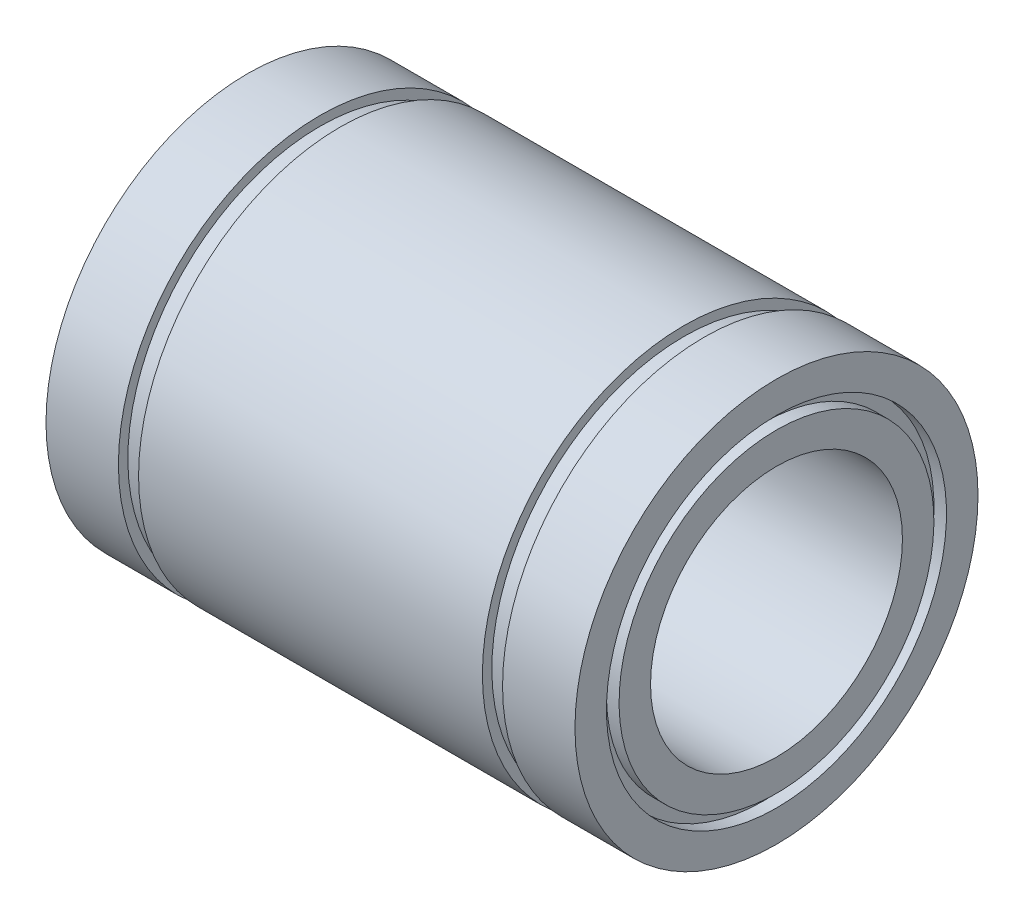
ISO-10303-21;
HEADER;
FILE_DESCRIPTION(('STEP AP214'),'2;1');
FILE_NAME('part.step','',(''),(''),'','','');
FILE_SCHEMA(('AUTOMOTIVE_DESIGN { 1 0 10303 214 1 1 1 1 }'));
ENDSEC;
DATA;
#1=APPLICATION_CONTEXT('core data for automotive mechanical design processes');
#2=APPLICATION_PROTOCOL_DEFINITION('international standard','automotive_design',2000,#1);
#3=PRODUCT_CONTEXT('',#1,'mechanical');
#4=PRODUCT('Part','Part','',(#3));
#5=PRODUCT_RELATED_PRODUCT_CATEGORY('part','',(#4));
#6=PRODUCT_DEFINITION_FORMATION('','',#4);
#7=PRODUCT_DEFINITION_CONTEXT('part definition',#1,'design');
#8=PRODUCT_DEFINITION('design','',#6,#7);
#9=PRODUCT_DEFINITION_SHAPE('','',#8);
#10=(LENGTH_UNIT() NAMED_UNIT(*) SI_UNIT(.MILLI.,.METRE.));
#11=(NAMED_UNIT(*) PLANE_ANGLE_UNIT() SI_UNIT($,.RADIAN.));
#12=(NAMED_UNIT(*) SI_UNIT($,.STERADIAN.) SOLID_ANGLE_UNIT());
#13=UNCERTAINTY_MEASURE_WITH_UNIT(LENGTH_MEASURE(1.E-05),#10,'distance_accuracy_value','');
#14=(GEOMETRIC_REPRESENTATION_CONTEXT(3) GLOBAL_UNCERTAINTY_ASSIGNED_CONTEXT((#13)) GLOBAL_UNIT_ASSIGNED_CONTEXT((#10,
#11,#12)) REPRESENTATION_CONTEXT('',''));
#15=CARTESIAN_POINT('',(0.,0.,0.));
#16=DIRECTION('',(0.,0.,1.));
#17=DIRECTION('',(1.,0.,0.));
#18=AXIS2_PLACEMENT_3D('',#15,#16,#17);
#19=CARTESIAN_POINT('',(-21.,13.5,0.));
#20=DIRECTION('',(-1.,0.,0.));
#21=DIRECTION('',(0.,-1.,0.));
#22=AXIS2_PLACEMENT_3D('',#19,#20,#21);
#23=PLANE('',#22);
#24=CARTESIAN_POINT('',(-21.,0.,0.));
#25=DIRECTION('',(1.,0.,0.));
#26=DIRECTION('',(0.,1.,0.));
#27=AXIS2_PLACEMENT_3D('',#24,#25,#26);
#28=CIRCLE('',#27,13.5);
#29=CARTESIAN_POINT('',(-21.,13.5,0.));
#30=VERTEX_POINT('',#29);
#31=EDGE_CURVE('E121',#30,#30,#28,.T.);
#32=ORIENTED_EDGE('',*,*,#31,.T.);
#33=EDGE_LOOP('',(#32));
#34=FACE_BOUND('',#33,.T.);
#35=CARTESIAN_POINT('',(-21.,0.,0.));
#36=DIRECTION('',(1.,0.,0.));
#37=DIRECTION('',(0.,1.,0.));
#38=AXIS2_PLACEMENT_3D('',#35,#36,#37);
#39=CIRCLE('',#38,16.);
#40=CARTESIAN_POINT('',(-21.,16.,0.));
#41=VERTEX_POINT('',#40);
#42=EDGE_CURVE('E10',#41,#41,#39,.T.);
#43=ORIENTED_EDGE('',*,*,#42,.F.);
#44=EDGE_LOOP('',(#43));
#45=FACE_BOUND('',#44,.T.);
#46=ADVANCED_FACE('F38',(#34,#45),#23,.T.);
#47=CARTESIAN_POINT('',(0.,0.,0.));
#48=DIRECTION('',(1.,0.,0.));
#49=DIRECTION('',(0.,1.,0.));
#50=AXIS2_PLACEMENT_3D('',#47,#48,#49);
#51=CYLINDRICAL_SURFACE('',#50,16.);
#52=ORIENTED_EDGE('',*,*,#42,.T.);
#53=EDGE_LOOP('',(#52));
#54=FACE_BOUND('',#53,.T.);
#55=CARTESIAN_POINT('',(-15.25,0.,0.));
#56=DIRECTION('',(1.,0.,0.));
#57=DIRECTION('',(0.,1.,0.));
#58=AXIS2_PLACEMENT_3D('',#55,#56,#57);
#59=CIRCLE('',#58,16.);
#60=CARTESIAN_POINT('',(-15.25,16.,0.));
#61=VERTEX_POINT('',#60);
#62=EDGE_CURVE('E45',#61,#61,#59,.T.);
#63=ORIENTED_EDGE('',*,*,#62,.F.);
#64=EDGE_LOOP('',(#63));
#65=FACE_BOUND('',#64,.T.);
#66=ADVANCED_FACE('F140',(#54,#65),#51,.T.);
#67=CARTESIAN_POINT('',(-15.25,16.,0.));
#68=DIRECTION('',(1.,0.,0.));
#69=DIRECTION('',(0.,1.,0.));
#70=AXIS2_PLACEMENT_3D('',#67,#68,#69);
#71=PLANE('',#70);
#72=ORIENTED_EDGE('',*,*,#62,.T.);
#73=EDGE_LOOP('',(#72));
#74=FACE_BOUND('',#73,.T.);
#75=CARTESIAN_POINT('',(-15.25,0.,0.));
#76=DIRECTION('',(1.,0.,0.));
#77=DIRECTION('',(0.,1.,0.));
#78=AXIS2_PLACEMENT_3D('',#75,#76,#77);
#79=CIRCLE('',#78,15.25);
#80=CARTESIAN_POINT('',(-15.25,15.25,0.));
#81=VERTEX_POINT('',#80);
#82=EDGE_CURVE('E52',#81,#81,#79,.T.);
#83=ORIENTED_EDGE('',*,*,#82,.F.);
#84=EDGE_LOOP('',(#83));
#85=FACE_BOUND('',#84,.T.);
#86=ADVANCED_FACE('F144',(#74,#85),#71,.T.);
#87=CARTESIAN_POINT('',(0.,0.,0.));
#88=DIRECTION('',(1.,0.,0.));
#89=DIRECTION('',(0.,1.,0.));
#90=AXIS2_PLACEMENT_3D('',#87,#88,#89);
#91=CYLINDRICAL_SURFACE('',#90,15.25);
#92=ORIENTED_EDGE('',*,*,#82,.T.);
#93=EDGE_LOOP('',(#92));
#94=FACE_BOUND('',#93,.T.);
#95=CARTESIAN_POINT('',(-13.65,0.,0.));
#96=DIRECTION('',(1.,0.,0.));
#97=DIRECTION('',(0.,1.,0.));
#98=AXIS2_PLACEMENT_3D('',#95,#96,#97);
#99=CIRCLE('',#98,15.25);
#100=CARTESIAN_POINT('',(-13.65,15.25,0.));
#101=VERTEX_POINT('',#100);
#102=EDGE_CURVE('E58',#101,#101,#99,.T.);
#103=ORIENTED_EDGE('',*,*,#102,.F.);
#104=EDGE_LOOP('',(#103));
#105=FACE_BOUND('',#104,.T.);
#106=ADVANCED_FACE('F148',(#94,#105),#91,.T.);
#107=CARTESIAN_POINT('',(-13.65,15.25,0.));
#108=DIRECTION('',(-1.,0.,0.));
#109=DIRECTION('',(0.,-1.,0.));
#110=AXIS2_PLACEMENT_3D('',#107,#108,#109);
#111=PLANE('',#110);
#112=ORIENTED_EDGE('',*,*,#102,.T.);
#113=EDGE_LOOP('',(#112));
#114=FACE_BOUND('',#113,.T.);
#115=CARTESIAN_POINT('',(-13.65,0.,0.));
#116=DIRECTION('',(1.,0.,0.));
#117=DIRECTION('',(0.,1.,0.));
#118=AXIS2_PLACEMENT_3D('',#115,#116,#117);
#119=CIRCLE('',#118,16.);
#120=CARTESIAN_POINT('',(-13.65,16.,0.));
#121=VERTEX_POINT('',#120);
#122=EDGE_CURVE('E64',#121,#121,#119,.T.);
#123=ORIENTED_EDGE('',*,*,#122,.F.);
#124=EDGE_LOOP('',(#123));
#125=FACE_BOUND('',#124,.T.);
#126=ADVANCED_FACE('F154',(#114,#125),#111,.T.);
#127=CARTESIAN_POINT('',(0.,0.,0.));
#128=DIRECTION('',(1.,0.,0.));
#129=DIRECTION('',(0.,1.,0.));
#130=AXIS2_PLACEMENT_3D('',#127,#128,#129);
#131=CYLINDRICAL_SURFACE('',#130,16.);
#132=ORIENTED_EDGE('',*,*,#122,.T.);
#133=EDGE_LOOP('',(#132));
#134=FACE_BOUND('',#133,.T.);
#135=CARTESIAN_POINT('',(13.65,0.,0.));
#136=DIRECTION('',(1.,0.,0.));
#137=DIRECTION('',(0.,1.,0.));
#138=AXIS2_PLACEMENT_3D('',#135,#136,#137);
#139=CIRCLE('',#138,16.);
#140=CARTESIAN_POINT('',(13.65,16.,0.));
#141=VERTEX_POINT('',#140);
#142=EDGE_CURVE('E68',#141,#141,#139,.T.);
#143=ORIENTED_EDGE('',*,*,#142,.F.);
#144=EDGE_LOOP('',(#143));
#145=FACE_BOUND('',#144,.T.);
#146=ADVANCED_FACE('F158',(#134,#145),#131,.T.);
#147=CARTESIAN_POINT('',(13.65,16.,0.));
#148=DIRECTION('',(1.,0.,0.));
#149=DIRECTION('',(0.,1.,0.));
#150=AXIS2_PLACEMENT_3D('',#147,#148,#149);
#151=PLANE('',#150);
#152=ORIENTED_EDGE('',*,*,#142,.T.);
#153=EDGE_LOOP('',(#152));
#154=FACE_BOUND('',#153,.T.);
#155=CARTESIAN_POINT('',(13.65,0.,0.));
#156=DIRECTION('',(1.,0.,0.));
#157=DIRECTION('',(0.,1.,0.));
#158=AXIS2_PLACEMENT_3D('',#155,#156,#157);
#159=CIRCLE('',#158,15.25);
#160=CARTESIAN_POINT('',(13.65,15.25,0.));
#161=VERTEX_POINT('',#160);
#162=EDGE_CURVE('E72',#161,#161,#159,.T.);
#163=ORIENTED_EDGE('',*,*,#162,.F.);
#164=EDGE_LOOP('',(#163));
#165=FACE_BOUND('',#164,.T.);
#166=ADVANCED_FACE('F162',(#154,#165),#151,.T.);
#167=CARTESIAN_POINT('',(0.,0.,0.));
#168=DIRECTION('',(1.,0.,0.));
#169=DIRECTION('',(0.,1.,0.));
#170=AXIS2_PLACEMENT_3D('',#167,#168,#169);
#171=CYLINDRICAL_SURFACE('',#170,15.25);
#172=ORIENTED_EDGE('',*,*,#162,.T.);
#173=EDGE_LOOP('',(#172));
#174=FACE_BOUND('',#173,.T.);
#175=CARTESIAN_POINT('',(15.25,0.,0.));
#176=DIRECTION('',(1.,0.,0.));
#177=DIRECTION('',(0.,1.,0.));
#178=AXIS2_PLACEMENT_3D('',#175,#176,#177);
#179=CIRCLE('',#178,15.25);
#180=CARTESIAN_POINT('',(15.25,15.25,0.));
#181=VERTEX_POINT('',#180);
#182=EDGE_CURVE('E76',#181,#181,#179,.T.);
#183=ORIENTED_EDGE('',*,*,#182,.F.);
#184=EDGE_LOOP('',(#183));
#185=FACE_BOUND('',#184,.T.);
#186=ADVANCED_FACE('F166',(#174,#185),#171,.T.);
#187=CARTESIAN_POINT('',(15.25,15.25,0.));
#188=DIRECTION('',(-1.,0.,0.));
#189=DIRECTION('',(0.,-1.,0.));
#190=AXIS2_PLACEMENT_3D('',#187,#188,#189);
#191=PLANE('',#190);
#192=ORIENTED_EDGE('',*,*,#182,.T.);
#193=EDGE_LOOP('',(#192));
#194=FACE_BOUND('',#193,.T.);
#195=CARTESIAN_POINT('',(15.25,0.,0.));
#196=DIRECTION('',(1.,0.,0.));
#197=DIRECTION('',(0.,1.,0.));
#198=AXIS2_PLACEMENT_3D('',#195,#196,#197);
#199=CIRCLE('',#198,16.);
#200=CARTESIAN_POINT('',(15.25,16.,0.));
#201=VERTEX_POINT('',#200);
#202=EDGE_CURVE('E79',#201,#201,#199,.T.);
#203=ORIENTED_EDGE('',*,*,#202,.F.);
#204=EDGE_LOOP('',(#203));
#205=FACE_BOUND('',#204,.T.);
#206=ADVANCED_FACE('F170',(#194,#205),#191,.T.);
#207=CARTESIAN_POINT('',(0.,0.,0.));
#208=DIRECTION('',(1.,0.,0.));
#209=DIRECTION('',(0.,1.,0.));
#210=AXIS2_PLACEMENT_3D('',#207,#208,#209);
#211=CYLINDRICAL_SURFACE('',#210,16.);
#212=ORIENTED_EDGE('',*,*,#202,.T.);
#213=EDGE_LOOP('',(#212));
#214=FACE_BOUND('',#213,.T.);
#215=CARTESIAN_POINT('',(21.,0.,0.));
#216=DIRECTION('',(1.,0.,0.));
#217=DIRECTION('',(0.,1.,0.));
#218=AXIS2_PLACEMENT_3D('',#215,#216,#217);
#219=CIRCLE('',#218,16.);
#220=CARTESIAN_POINT('',(21.,16.,0.));
#221=VERTEX_POINT('',#220);
#222=EDGE_CURVE('E83',#221,#221,#219,.T.);
#223=ORIENTED_EDGE('',*,*,#222,.F.);
#224=EDGE_LOOP('',(#223));
#225=FACE_BOUND('',#224,.T.);
#226=ADVANCED_FACE('F174',(#214,#225),#211,.T.);
#227=CARTESIAN_POINT('',(21.,16.,0.));
#228=DIRECTION('',(1.,0.,0.));
#229=DIRECTION('',(0.,1.,0.));
#230=AXIS2_PLACEMENT_3D('',#227,#228,#229);
#231=PLANE('',#230);
#232=ORIENTED_EDGE('',*,*,#222,.T.);
#233=EDGE_LOOP('',(#232));
#234=FACE_BOUND('',#233,.T.);
#235=CARTESIAN_POINT('',(21.,0.,0.));
#236=DIRECTION('',(1.,0.,0.));
#237=DIRECTION('',(0.,1.,0.));
#238=AXIS2_PLACEMENT_3D('',#235,#236,#237);
#239=CIRCLE('',#238,13.5);
#240=CARTESIAN_POINT('',(21.,13.5,0.));
#241=VERTEX_POINT('',#240);
#242=EDGE_CURVE('E87',#241,#241,#239,.T.);
#243=ORIENTED_EDGE('',*,*,#242,.F.);
#244=EDGE_LOOP('',(#243));
#245=FACE_BOUND('',#244,.T.);
#246=ADVANCED_FACE('F178',(#234,#245),#231,.T.);
#247=CARTESIAN_POINT('',(0.,0.,0.));
#248=DIRECTION('',(1.,0.,0.));
#249=DIRECTION('',(0.,1.,0.));
#250=AXIS2_PLACEMENT_3D('',#247,#248,#249);
#251=CYLINDRICAL_SURFACE('',#250,13.5);
#252=ORIENTED_EDGE('',*,*,#242,.T.);
#253=EDGE_LOOP('',(#252));
#254=FACE_BOUND('',#253,.T.);
#255=CARTESIAN_POINT('',(20.,0.,0.));
#256=DIRECTION('',(1.,0.,0.));
#257=DIRECTION('',(0.,1.,0.));
#258=AXIS2_PLACEMENT_3D('',#255,#256,#257);
#259=CIRCLE('',#258,13.5);
#260=CARTESIAN_POINT('',(20.,13.5,0.));
#261=VERTEX_POINT('',#260);
#262=EDGE_CURVE('E91',#261,#261,#259,.T.);
#263=ORIENTED_EDGE('',*,*,#262,.F.);
#264=EDGE_LOOP('',(#263));
#265=FACE_BOUND('',#264,.T.);
#266=ADVANCED_FACE('F182',(#254,#265),#251,.F.);
#267=CARTESIAN_POINT('',(20.,13.5,0.));
#268=DIRECTION('',(1.,0.,0.));
#269=DIRECTION('',(0.,1.,0.));
#270=AXIS2_PLACEMENT_3D('',#267,#268,#269);
#271=PLANE('',#270);
#272=ORIENTED_EDGE('',*,*,#262,.T.);
#273=EDGE_LOOP('',(#272));
#274=FACE_BOUND('',#273,.T.);
#275=CARTESIAN_POINT('',(20.,0.,0.));
#276=DIRECTION('',(1.,0.,0.));
#277=DIRECTION('',(0.,1.,0.));
#278=AXIS2_PLACEMENT_3D('',#275,#276,#277);
#279=CIRCLE('',#278,12.5);
#280=CARTESIAN_POINT('',(20.,12.5,0.));
#281=VERTEX_POINT('',#280);
#282=EDGE_CURVE('E95',#281,#281,#279,.T.);
#283=ORIENTED_EDGE('',*,*,#282,.F.);
#284=EDGE_LOOP('',(#283));
#285=FACE_BOUND('',#284,.T.);
#286=ADVANCED_FACE('F186',(#274,#285),#271,.T.);
#287=CARTESIAN_POINT('',(0.,0.,0.));
#288=DIRECTION('',(1.,0.,0.));
#289=DIRECTION('',(0.,1.,0.));
#290=AXIS2_PLACEMENT_3D('',#287,#288,#289);
#291=CYLINDRICAL_SURFACE('',#290,12.5);
#292=ORIENTED_EDGE('',*,*,#282,.T.);
#293=EDGE_LOOP('',(#292));
#294=FACE_BOUND('',#293,.T.);
#295=CARTESIAN_POINT('',(21.,0.,0.));
#296=DIRECTION('',(1.,0.,0.));
#297=DIRECTION('',(0.,1.,0.));
#298=AXIS2_PLACEMENT_3D('',#295,#296,#297);
#299=CIRCLE('',#298,12.5);
#300=CARTESIAN_POINT('',(21.,12.5,0.));
#301=VERTEX_POINT('',#300);
#302=EDGE_CURVE('E99',#301,#301,#299,.T.);
#303=ORIENTED_EDGE('',*,*,#302,.F.);
#304=EDGE_LOOP('',(#303));
#305=FACE_BOUND('',#304,.T.);
#306=ADVANCED_FACE('F190',(#294,#305),#291,.T.);
#307=CARTESIAN_POINT('',(21.,12.5,0.));
#308=DIRECTION('',(1.,0.,0.));
#309=DIRECTION('',(0.,1.,0.));
#310=AXIS2_PLACEMENT_3D('',#307,#308,#309);
#311=PLANE('',#310);
#312=ORIENTED_EDGE('',*,*,#302,.T.);
#313=EDGE_LOOP('',(#312));
#314=FACE_BOUND('',#313,.T.);
#315=CARTESIAN_POINT('',(21.,0.,0.));
#316=DIRECTION('',(1.,0.,0.));
#317=DIRECTION('',(0.,1.,0.));
#318=AXIS2_PLACEMENT_3D('',#315,#316,#317);
#319=CIRCLE('',#318,10.);
#320=CARTESIAN_POINT('',(21.,10.,0.));
#321=VERTEX_POINT('',#320);
#322=EDGE_CURVE('E102',#321,#321,#319,.T.);
#323=ORIENTED_EDGE('',*,*,#322,.F.);
#324=EDGE_LOOP('',(#323));
#325=FACE_BOUND('',#324,.T.);
#326=ADVANCED_FACE('F194',(#314,#325),#311,.T.);
#327=CARTESIAN_POINT('',(0.,0.,0.));
#328=DIRECTION('',(1.,0.,0.));
#329=DIRECTION('',(0.,1.,0.));
#330=AXIS2_PLACEMENT_3D('',#327,#328,#329);
#331=CYLINDRICAL_SURFACE('',#330,10.);
#332=ORIENTED_EDGE('',*,*,#322,.T.);
#333=EDGE_LOOP('',(#332));
#334=FACE_BOUND('',#333,.T.);
#335=CARTESIAN_POINT('',(-21.,0.,0.));
#336=DIRECTION('',(1.,0.,0.));
#337=DIRECTION('',(0.,1.,0.));
#338=AXIS2_PLACEMENT_3D('',#335,#336,#337);
#339=CIRCLE('',#338,10.);
#340=CARTESIAN_POINT('',(-21.,10.,0.));
#341=VERTEX_POINT('',#340);
#342=EDGE_CURVE('E106',#341,#341,#339,.T.);
#343=ORIENTED_EDGE('',*,*,#342,.F.);
#344=EDGE_LOOP('',(#343));
#345=FACE_BOUND('',#344,.T.);
#346=ADVANCED_FACE('F198',(#334,#345),#331,.F.);
#347=CARTESIAN_POINT('',(-21.,10.,0.));
#348=DIRECTION('',(-1.,0.,0.));
#349=DIRECTION('',(0.,-1.,0.));
#350=AXIS2_PLACEMENT_3D('',#347,#348,#349);
#351=PLANE('',#350);
#352=ORIENTED_EDGE('',*,*,#342,.T.);
#353=EDGE_LOOP('',(#352));
#354=FACE_BOUND('',#353,.T.);
#355=CARTESIAN_POINT('',(-21.,0.,0.));
#356=DIRECTION('',(1.,0.,0.));
#357=DIRECTION('',(0.,1.,0.));
#358=AXIS2_PLACEMENT_3D('',#355,#356,#357);
#359=CIRCLE('',#358,12.5);
#360=CARTESIAN_POINT('',(-21.,12.5,0.));
#361=VERTEX_POINT('',#360);
#362=EDGE_CURVE('E110',#361,#361,#359,.T.);
#363=ORIENTED_EDGE('',*,*,#362,.F.);
#364=EDGE_LOOP('',(#363));
#365=FACE_BOUND('',#364,.T.);
#366=ADVANCED_FACE('F202',(#354,#365),#351,.T.);
#367=CARTESIAN_POINT('',(0.,0.,0.));
#368=DIRECTION('',(1.,0.,0.));
#369=DIRECTION('',(0.,1.,0.));
#370=AXIS2_PLACEMENT_3D('',#367,#368,#369);
#371=CYLINDRICAL_SURFACE('',#370,12.5);
#372=ORIENTED_EDGE('',*,*,#362,.T.);
#373=EDGE_LOOP('',(#372));
#374=FACE_BOUND('',#373,.T.);
#375=CARTESIAN_POINT('',(-20.,0.,0.));
#376=DIRECTION('',(1.,0.,0.));
#377=DIRECTION('',(0.,1.,0.));
#378=AXIS2_PLACEMENT_3D('',#375,#376,#377);
#379=CIRCLE('',#378,12.5);
#380=CARTESIAN_POINT('',(-20.,12.5,0.));
#381=VERTEX_POINT('',#380);
#382=EDGE_CURVE('E114',#381,#381,#379,.T.);
#383=ORIENTED_EDGE('',*,*,#382,.F.);
#384=EDGE_LOOP('',(#383));
#385=FACE_BOUND('',#384,.T.);
#386=ADVANCED_FACE('F136',(#374,#385),#371,.T.);
#387=CARTESIAN_POINT('',(-20.,13.5,0.));
#388=DIRECTION('',(-1.,0.,0.));
#389=DIRECTION('',(0.,-1.,0.));
#390=AXIS2_PLACEMENT_3D('',#387,#388,#389);
#391=PLANE('',#390);
#392=ORIENTED_EDGE('',*,*,#382,.T.);
#393=EDGE_LOOP('',(#392));
#394=FACE_BOUND('',#393,.T.);
#395=CARTESIAN_POINT('',(-20.,0.,0.));
#396=DIRECTION('',(1.,0.,0.));
#397=DIRECTION('',(0.,1.,0.));
#398=AXIS2_PLACEMENT_3D('',#395,#396,#397);
#399=CIRCLE('',#398,13.5);
#400=CARTESIAN_POINT('',(-20.,13.5,0.));
#401=VERTEX_POINT('',#400);
#402=EDGE_CURVE('E117',#401,#401,#399,.T.);
#403=ORIENTED_EDGE('',*,*,#402,.F.);
#404=EDGE_LOOP('',(#403));
#405=FACE_BOUND('',#404,.T.);
#406=ADVANCED_FACE('F130',(#394,#405),#391,.T.);
#407=CARTESIAN_POINT('',(0.,0.,0.));
#408=DIRECTION('',(1.,0.,0.));
#409=DIRECTION('',(0.,1.,0.));
#410=AXIS2_PLACEMENT_3D('',#407,#408,#409);
#411=CYLINDRICAL_SURFACE('',#410,13.5);
#412=ORIENTED_EDGE('',*,*,#402,.T.);
#413=EDGE_LOOP('',(#412));
#414=FACE_BOUND('',#413,.T.);
#415=ORIENTED_EDGE('',*,*,#31,.F.);
#416=EDGE_LOOP('',(#415));
#417=FACE_BOUND('',#416,.T.);
#418=ADVANCED_FACE('F128',(#414,#417),#411,.F.);
#419=CLOSED_SHELL('',(#46,#66,#86,#106,#126,#146,#166,#186,#206,#226,#246,#266,#286,#306,#326,
#346,#366,#386,#406,#418));
#420=MANIFOLD_SOLID_BREP('B2',#419);
#421=ADVANCED_BREP_SHAPE_REPRESENTATION('',(#18,#420),#14);
#422=SHAPE_DEFINITION_REPRESENTATION(#9,#421);
ENDSEC;
END-ISO-10303-21;
